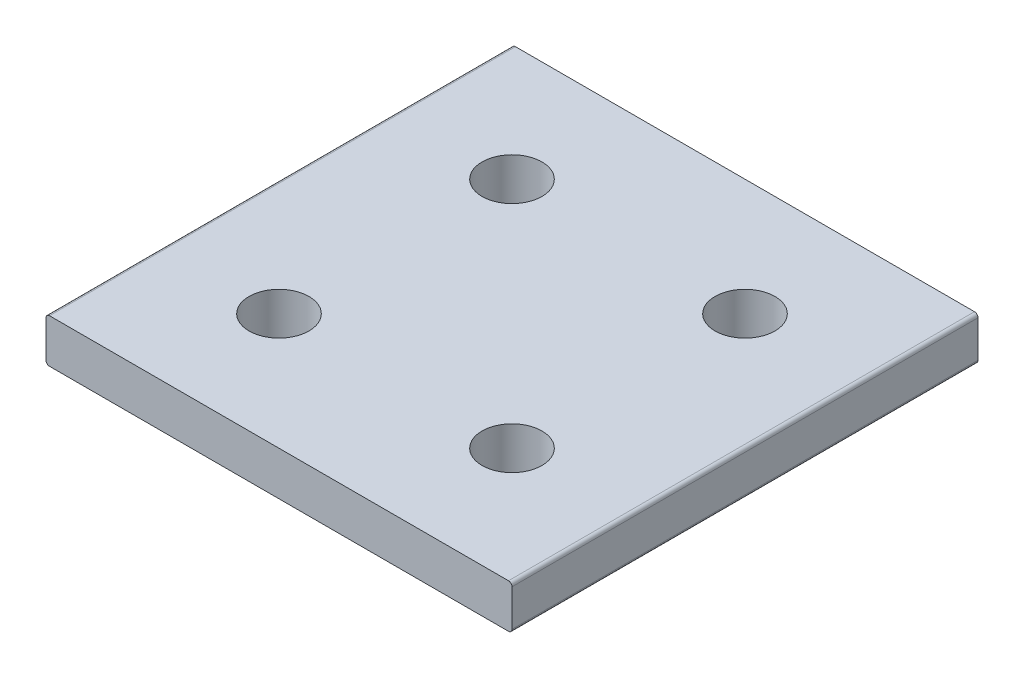
ISO-10303-21;
HEADER;
FILE_DESCRIPTION(('STEP AP214'),'2;1');
FILE_NAME('part.step','',(''),(''),'','','');
FILE_SCHEMA(('AUTOMOTIVE_DESIGN { 1 0 10303 214 1 1 1 1 }'));
ENDSEC;
DATA;
#1=APPLICATION_CONTEXT('core data for automotive mechanical design processes');
#2=APPLICATION_PROTOCOL_DEFINITION('international standard','automotive_design',2000,#1);
#3=PRODUCT_CONTEXT('',#1,'mechanical');
#4=PRODUCT('Part','Part','',(#3));
#5=PRODUCT_RELATED_PRODUCT_CATEGORY('part','',(#4));
#6=PRODUCT_DEFINITION_FORMATION('','',#4);
#7=PRODUCT_DEFINITION_CONTEXT('part definition',#1,'design');
#8=PRODUCT_DEFINITION('design','',#6,#7);
#9=PRODUCT_DEFINITION_SHAPE('','',#8);
#10=(LENGTH_UNIT() NAMED_UNIT(*) SI_UNIT(.MILLI.,.METRE.));
#11=(NAMED_UNIT(*) PLANE_ANGLE_UNIT() SI_UNIT($,.RADIAN.));
#12=(NAMED_UNIT(*) SI_UNIT($,.STERADIAN.) SOLID_ANGLE_UNIT());
#13=UNCERTAINTY_MEASURE_WITH_UNIT(LENGTH_MEASURE(1.E-05),#10,'distance_accuracy_value','');
#14=(GEOMETRIC_REPRESENTATION_CONTEXT(3) GLOBAL_UNCERTAINTY_ASSIGNED_CONTEXT((#13)) GLOBAL_UNIT_ASSIGNED_CONTEXT((#10,
#11,#12)) REPRESENTATION_CONTEXT('',''));
#15=CARTESIAN_POINT('',(0.,0.,0.));
#16=DIRECTION('',(0.,0.,1.));
#17=DIRECTION('',(1.,0.,0.));
#18=AXIS2_PLACEMENT_3D('',#15,#16,#17);
#19=CARTESIAN_POINT('',(0.,4.7752,50.8));
#20=DIRECTION('',(-1.,0.,0.));
#21=DIRECTION('',(0.,0.,1.));
#22=AXIS2_PLACEMENT_3D('',#19,#20,#21);
#23=PLANE('',#22);
#24=DIRECTION('',(0.,-1.,0.));
#25=VECTOR('',#24,1.);
#26=CARTESIAN_POINT('',(0.,4.7752,50.8));
#27=LINE('',#26,#25);
#28=CARTESIAN_POINT('',(0.,4.39420000000004,50.8));
#29=VERTEX_POINT('',#28);
#30=CARTESIAN_POINT('',(0.,0.380999999999964,50.8));
#31=VERTEX_POINT('',#30);
#32=EDGE_CURVE('E102',#29,#31,#27,.T.);
#33=ORIENTED_EDGE('',*,*,#32,.F.);
#34=DIRECTION('',(0.,0.,-1.));
#35=VECTOR('',#34,1.);
#36=CARTESIAN_POINT('',(0.,4.39420000000004,0.));
#37=LINE('',#36,#35);
#38=CARTESIAN_POINT('',(0.,4.39420000000004,0.));
#39=VERTEX_POINT('',#38);
#40=EDGE_CURVE('E114',#29,#39,#37,.T.);
#41=ORIENTED_EDGE('',*,*,#40,.T.);
#42=DIRECTION('',(0.,-1.,0.));
#43=VECTOR('',#42,1.);
#44=CARTESIAN_POINT('',(0.,4.7752,0.));
#45=LINE('',#44,#43);
#46=CARTESIAN_POINT('',(0.,0.380999999999964,0.));
#47=VERTEX_POINT('',#46);
#48=EDGE_CURVE('E245',#39,#47,#45,.T.);
#49=ORIENTED_EDGE('',*,*,#48,.T.);
#50=DIRECTION('',(0.,0.,-1.));
#51=VECTOR('',#50,1.);
#52=CARTESIAN_POINT('',(0.,0.380999999999964,50.8));
#53=LINE('',#52,#51);
#54=EDGE_CURVE('E117',#47,#31,#53,.F.);
#55=ORIENTED_EDGE('',*,*,#54,.T.);
#56=EDGE_LOOP('',(#33,#41,#49,#55));
#57=FACE_BOUND('',#56,.T.);
#58=ADVANCED_FACE('F32',(#57),#23,.T.);
#59=CARTESIAN_POINT('',(50.8,4.7752,50.8));
#60=DIRECTION('',(0.,0.,1.));
#61=DIRECTION('',(1.,0.,0.));
#62=AXIS2_PLACEMENT_3D('',#59,#60,#61);
#63=PLANE('',#62);
#64=DIRECTION('',(-1.,0.,0.));
#65=VECTOR('',#64,1.);
#66=CARTESIAN_POINT('',(50.8,4.7752,50.8));
#67=LINE('',#66,#65);
#68=CARTESIAN_POINT('',(50.419,4.7752,50.8));
#69=VERTEX_POINT('',#68);
#70=CARTESIAN_POINT('',(0.380999999999979,4.7752,50.8));
#71=VERTEX_POINT('',#70);
#72=EDGE_CURVE('E105',#69,#71,#67,.T.);
#73=ORIENTED_EDGE('',*,*,#72,.T.);
#74=CARTESIAN_POINT('',(0.380999999999964,4.39420000000004,50.8));
#75=DIRECTION('',(0.,0.,1.));
#76=DIRECTION('',(1.,0.,0.));
#77=AXIS2_PLACEMENT_3D('',#74,#75,#76);
#78=CIRCLE('',#77,0.380999999999964);
#79=EDGE_CURVE('E99',#71,#29,#78,.T.);
#80=ORIENTED_EDGE('',*,*,#79,.T.);
#81=ORIENTED_EDGE('',*,*,#32,.T.);
#82=CARTESIAN_POINT('',(0.380999999999964,0.380999999999964,50.8));
#83=DIRECTION('',(0.,0.,1.));
#84=DIRECTION('',(1.,0.,0.));
#85=AXIS2_PLACEMENT_3D('',#82,#83,#84);
#86=CIRCLE('',#85,0.380999999999964);
#87=CARTESIAN_POINT('',(0.380999999999979,0.,50.8));
#88=VERTEX_POINT('',#87);
#89=EDGE_CURVE('E138',#31,#88,#86,.T.);
#90=ORIENTED_EDGE('',*,*,#89,.T.);
#91=DIRECTION('',(-1.,0.,0.));
#92=VECTOR('',#91,1.);
#93=CARTESIAN_POINT('',(50.8,0.,50.8));
#94=LINE('',#93,#92);
#95=CARTESIAN_POINT('',(50.419,0.,50.8));
#96=VERTEX_POINT('',#95);
#97=EDGE_CURVE('E243',#96,#88,#94,.T.);
#98=ORIENTED_EDGE('',*,*,#97,.F.);
#99=CARTESIAN_POINT('',(50.419,0.380999999999964,50.8));
#100=DIRECTION('',(0.,0.,1.));
#101=DIRECTION('',(1.,0.,0.));
#102=AXIS2_PLACEMENT_3D('',#99,#100,#101);
#103=CIRCLE('',#102,0.380999999999964);
#104=CARTESIAN_POINT('',(50.8,0.380999999999964,50.8));
#105=VERTEX_POINT('',#104);
#106=EDGE_CURVE('E47',#96,#105,#103,.T.);
#107=ORIENTED_EDGE('',*,*,#106,.T.);
#108=DIRECTION('',(0.,-1.,0.));
#109=VECTOR('',#108,1.);
#110=CARTESIAN_POINT('',(50.8,4.7752,50.8));
#111=LINE('',#110,#109);
#112=CARTESIAN_POINT('',(50.8,4.39420000000004,50.8));
#113=VERTEX_POINT('',#112);
#114=EDGE_CURVE('E118',#113,#105,#111,.T.);
#115=ORIENTED_EDGE('',*,*,#114,.F.);
#116=CARTESIAN_POINT('',(50.419,4.39420000000004,50.8));
#117=DIRECTION('',(0.,0.,1.));
#118=DIRECTION('',(1.,0.,0.));
#119=AXIS2_PLACEMENT_3D('',#116,#117,#118);
#120=CIRCLE('',#119,0.380999999999964);
#121=EDGE_CURVE('E55',#113,#69,#120,.T.);
#122=ORIENTED_EDGE('',*,*,#121,.T.);
#123=EDGE_LOOP('',(#73,#80,#81,#90,#98,#107,#115,#122));
#124=FACE_BOUND('',#123,.T.);
#125=ADVANCED_FACE('F101',(#124),#63,.T.);
#126=CARTESIAN_POINT('',(50.8,4.7752,0.));
#127=DIRECTION('',(1.,0.,0.));
#128=DIRECTION('',(0.,0.,-1.));
#129=AXIS2_PLACEMENT_3D('',#126,#127,#128);
#130=PLANE('',#129);
#131=DIRECTION('',(0.,-1.,0.));
#132=VECTOR('',#131,1.);
#133=CARTESIAN_POINT('',(50.8,4.7752,0.));
#134=LINE('',#133,#132);
#135=CARTESIAN_POINT('',(50.8,4.39420000000004,0.));
#136=VERTEX_POINT('',#135);
#137=CARTESIAN_POINT('',(50.8,0.380999999999964,0.));
#138=VERTEX_POINT('',#137);
#139=EDGE_CURVE('E251',#136,#138,#134,.T.);
#140=ORIENTED_EDGE('',*,*,#139,.F.);
#141=DIRECTION('',(0.,0.,1.));
#142=VECTOR('',#141,1.);
#143=CARTESIAN_POINT('',(50.8,4.39420000000004,50.8));
#144=LINE('',#143,#142);
#145=EDGE_CURVE('E142',#136,#113,#144,.T.);
#146=ORIENTED_EDGE('',*,*,#145,.T.);
#147=ORIENTED_EDGE('',*,*,#114,.T.);
#148=DIRECTION('',(0.,0.,1.));
#149=VECTOR('',#148,1.);
#150=CARTESIAN_POINT('',(50.8,0.380999999999964,0.));
#151=LINE('',#150,#149);
#152=EDGE_CURVE('E109',#105,#138,#151,.F.);
#153=ORIENTED_EDGE('',*,*,#152,.T.);
#154=EDGE_LOOP('',(#140,#146,#147,#153));
#155=FACE_BOUND('',#154,.T.);
#156=ADVANCED_FACE('F177',(#155),#130,.T.);
#157=CARTESIAN_POINT('',(0.,4.7752,0.));
#158=DIRECTION('',(0.,0.,-1.));
#159=DIRECTION('',(-1.,0.,0.));
#160=AXIS2_PLACEMENT_3D('',#157,#158,#159);
#161=PLANE('',#160);
#162=ORIENTED_EDGE('',*,*,#48,.F.);
#163=CARTESIAN_POINT('',(0.380999999999964,4.39420000000004,0.));
#164=DIRECTION('',(0.,0.,-1.));
#165=DIRECTION('',(-1.,0.,0.));
#166=AXIS2_PLACEMENT_3D('',#163,#164,#165);
#167=CIRCLE('',#166,0.380999999999964);
#168=CARTESIAN_POINT('',(0.380999999999964,4.7752,0.));
#169=VERTEX_POINT('',#168);
#170=EDGE_CURVE('E121',#39,#169,#167,.T.);
#171=ORIENTED_EDGE('',*,*,#170,.T.);
#172=DIRECTION('',(1.,0.,0.));
#173=VECTOR('',#172,1.);
#174=CARTESIAN_POINT('',(0.,4.7752,0.));
#175=LINE('',#174,#173);
#176=CARTESIAN_POINT('',(50.419,4.7752,0.));
#177=VERTEX_POINT('',#176);
#178=EDGE_CURVE('E240',#169,#177,#175,.T.);
#179=ORIENTED_EDGE('',*,*,#178,.T.);
#180=CARTESIAN_POINT('',(50.419,4.39420000000004,0.));
#181=DIRECTION('',(0.,0.,-1.));
#182=DIRECTION('',(-1.,0.,0.));
#183=AXIS2_PLACEMENT_3D('',#180,#181,#182);
#184=CIRCLE('',#183,0.380999999999964);
#185=EDGE_CURVE('E130',#177,#136,#184,.T.);
#186=ORIENTED_EDGE('',*,*,#185,.T.);
#187=ORIENTED_EDGE('',*,*,#139,.T.);
#188=CARTESIAN_POINT('',(50.419,0.380999999999964,0.));
#189=DIRECTION('',(0.,0.,-1.));
#190=DIRECTION('',(-1.,0.,0.));
#191=AXIS2_PLACEMENT_3D('',#188,#189,#190);
#192=CIRCLE('',#191,0.380999999999964);
#193=CARTESIAN_POINT('',(50.419,0.,0.));
#194=VERTEX_POINT('',#193);
#195=EDGE_CURVE('E122',#138,#194,#192,.T.);
#196=ORIENTED_EDGE('',*,*,#195,.T.);
#197=DIRECTION('',(1.,0.,0.));
#198=VECTOR('',#197,1.);
#199=CARTESIAN_POINT('',(0.,0.,0.));
#200=LINE('',#199,#198);
#201=CARTESIAN_POINT('',(0.380999999999964,0.,0.));
#202=VERTEX_POINT('',#201);
#203=EDGE_CURVE('E233',#202,#194,#200,.T.);
#204=ORIENTED_EDGE('',*,*,#203,.F.);
#205=CARTESIAN_POINT('',(0.380999999999964,0.380999999999964,0.));
#206=DIRECTION('',(0.,0.,-1.));
#207=DIRECTION('',(-1.,0.,0.));
#208=AXIS2_PLACEMENT_3D('',#205,#206,#207);
#209=CIRCLE('',#208,0.380999999999964);
#210=EDGE_CURVE('E124',#202,#47,#209,.T.);
#211=ORIENTED_EDGE('',*,*,#210,.T.);
#212=EDGE_LOOP('',(#162,#171,#179,#186,#187,#196,#204,#211));
#213=FACE_BOUND('',#212,.T.);
#214=ADVANCED_FACE('F167',(#213),#161,.T.);
#215=CARTESIAN_POINT('',(0.,4.7752,0.));
#216=DIRECTION('',(0.,-1.,0.));
#217=DIRECTION('',(0.,0.,-1.));
#218=AXIS2_PLACEMENT_3D('',#215,#216,#217);
#219=PLANE('',#218);
#220=CARTESIAN_POINT('',(12.7,4.7752,38.1));
#221=DIRECTION('',(0.,1.,0.));
#222=DIRECTION('',(0.,0.,1.));
#223=AXIS2_PLACEMENT_3D('',#220,#221,#222);
#224=CIRCLE('',#223,3.2639);
#225=CARTESIAN_POINT('',(12.7,4.7752,41.3639));
#226=VERTEX_POINT('',#225);
#227=EDGE_CURVE('E231',#226,#226,#224,.T.);
#228=ORIENTED_EDGE('',*,*,#227,.F.);
#229=EDGE_LOOP('',(#228));
#230=FACE_BOUND('',#229,.T.);
#231=CARTESIAN_POINT('',(38.1,4.7752,38.1));
#232=DIRECTION('',(0.,1.,0.));
#233=DIRECTION('',(0.,0.,1.));
#234=AXIS2_PLACEMENT_3D('',#231,#232,#233);
#235=CIRCLE('',#234,3.2639);
#236=CARTESIAN_POINT('',(38.1,4.7752,41.3639));
#237=VERTEX_POINT('',#236);
#238=EDGE_CURVE('E230',#237,#237,#235,.T.);
#239=ORIENTED_EDGE('',*,*,#238,.F.);
#240=EDGE_LOOP('',(#239));
#241=FACE_BOUND('',#240,.T.);
#242=ORIENTED_EDGE('',*,*,#178,.F.);
#243=DIRECTION('',(0.,0.,-1.));
#244=VECTOR('',#243,1.);
#245=CARTESIAN_POINT('',(0.380999999999964,4.7752,50.8));
#246=LINE('',#245,#244);
#247=EDGE_CURVE('E135',#169,#71,#246,.F.);
#248=ORIENTED_EDGE('',*,*,#247,.T.);
#249=ORIENTED_EDGE('',*,*,#72,.F.);
#250=DIRECTION('',(0.,0.,1.));
#251=VECTOR('',#250,1.);
#252=CARTESIAN_POINT('',(50.419,4.7752,0.));
#253=LINE('',#252,#251);
#254=EDGE_CURVE('E133',#69,#177,#253,.F.);
#255=ORIENTED_EDGE('',*,*,#254,.T.);
#256=EDGE_LOOP('',(#242,#248,#249,#255));
#257=FACE_BOUND('',#256,.T.);
#258=CARTESIAN_POINT('',(38.1,4.7752,12.7));
#259=DIRECTION('',(0.,1.,0.));
#260=DIRECTION('',(0.,0.,1.));
#261=AXIS2_PLACEMENT_3D('',#258,#259,#260);
#262=CIRCLE('',#261,3.2639);
#263=CARTESIAN_POINT('',(38.1,4.7752,15.9639));
#264=VERTEX_POINT('',#263);
#265=EDGE_CURVE('E153',#264,#264,#262,.T.);
#266=ORIENTED_EDGE('',*,*,#265,.F.);
#267=EDGE_LOOP('',(#266));
#268=FACE_BOUND('',#267,.T.);
#269=CARTESIAN_POINT('',(12.7,4.7752,12.7));
#270=DIRECTION('',(0.,1.,0.));
#271=DIRECTION('',(0.,0.,1.));
#272=AXIS2_PLACEMENT_3D('',#269,#270,#271);
#273=CIRCLE('',#272,3.2639);
#274=CARTESIAN_POINT('',(12.7,4.7752,15.9639));
#275=VERTEX_POINT('',#274);
#276=EDGE_CURVE('E11',#275,#275,#273,.T.);
#277=ORIENTED_EDGE('',*,*,#276,.F.);
#278=EDGE_LOOP('',(#277));
#279=FACE_BOUND('',#278,.T.);
#280=ADVANCED_FACE('F165',(#230,#241,#257,#268,#279),#219,.F.);
#281=CARTESIAN_POINT('',(0.,0.,0.));
#282=DIRECTION('',(0.,-1.,0.));
#283=DIRECTION('',(0.,0.,-1.));
#284=AXIS2_PLACEMENT_3D('',#281,#282,#283);
#285=PLANE('',#284);
#286=CARTESIAN_POINT('',(12.7,0.,38.1));
#287=DIRECTION('',(0.,1.,0.));
#288=DIRECTION('',(0.,0.,1.));
#289=AXIS2_PLACEMENT_3D('',#286,#287,#288);
#290=CIRCLE('',#289,3.2639);
#291=CARTESIAN_POINT('',(12.7,0.,41.3639));
#292=VERTEX_POINT('',#291);
#293=EDGE_CURVE('E236',#292,#292,#290,.T.);
#294=ORIENTED_EDGE('',*,*,#293,.T.);
#295=EDGE_LOOP('',(#294));
#296=FACE_BOUND('',#295,.T.);
#297=CARTESIAN_POINT('',(38.1,0.,38.1));
#298=DIRECTION('',(0.,1.,0.));
#299=DIRECTION('',(0.,0.,1.));
#300=AXIS2_PLACEMENT_3D('',#297,#298,#299);
#301=CIRCLE('',#300,3.2639);
#302=CARTESIAN_POINT('',(38.1,0.,41.3639));
#303=VERTEX_POINT('',#302);
#304=EDGE_CURVE('E227',#303,#303,#301,.T.);
#305=ORIENTED_EDGE('',*,*,#304,.T.);
#306=EDGE_LOOP('',(#305));
#307=FACE_BOUND('',#306,.T.);
#308=ORIENTED_EDGE('',*,*,#97,.T.);
#309=DIRECTION('',(0.,0.,-1.));
#310=VECTOR('',#309,1.);
#311=CARTESIAN_POINT('',(0.380999999999964,0.,0.));
#312=LINE('',#311,#310);
#313=EDGE_CURVE('E147',#88,#202,#312,.T.);
#314=ORIENTED_EDGE('',*,*,#313,.T.);
#315=ORIENTED_EDGE('',*,*,#203,.T.);
#316=DIRECTION('',(0.,0.,1.));
#317=VECTOR('',#316,1.);
#318=CARTESIAN_POINT('',(50.419,0.,0.));
#319=LINE('',#318,#317);
#320=EDGE_CURVE('E144',#194,#96,#319,.T.);
#321=ORIENTED_EDGE('',*,*,#320,.T.);
#322=EDGE_LOOP('',(#308,#314,#315,#321));
#323=FACE_BOUND('',#322,.T.);
#324=CARTESIAN_POINT('',(38.1,0.,12.7));
#325=DIRECTION('',(0.,1.,0.));
#326=DIRECTION('',(0.,0.,1.));
#327=AXIS2_PLACEMENT_3D('',#324,#325,#326);
#328=CIRCLE('',#327,3.2639);
#329=CARTESIAN_POINT('',(38.1,0.,15.9639));
#330=VERTEX_POINT('',#329);
#331=EDGE_CURVE('E150',#330,#330,#328,.T.);
#332=ORIENTED_EDGE('',*,*,#331,.T.);
#333=EDGE_LOOP('',(#332));
#334=FACE_BOUND('',#333,.T.);
#335=CARTESIAN_POINT('',(12.7,0.,12.7));
#336=DIRECTION('',(0.,1.,0.));
#337=DIRECTION('',(0.,0.,1.));
#338=AXIS2_PLACEMENT_3D('',#335,#336,#337);
#339=CIRCLE('',#338,3.2639);
#340=CARTESIAN_POINT('',(12.7,0.,15.9639));
#341=VERTEX_POINT('',#340);
#342=EDGE_CURVE('E40',#341,#341,#339,.T.);
#343=ORIENTED_EDGE('',*,*,#342,.T.);
#344=EDGE_LOOP('',(#343));
#345=FACE_BOUND('',#344,.T.);
#346=ADVANCED_FACE('F158',(#296,#307,#323,#334,#345),#285,.T.);
#347=CARTESIAN_POINT('',(38.1,4.7752,38.1));
#348=DIRECTION('',(0.,1.,0.));
#349=DIRECTION('',(0.,0.,1.));
#350=AXIS2_PLACEMENT_3D('',#347,#348,#349);
#351=CYLINDRICAL_SURFACE('',#350,3.2639);
#352=ORIENTED_EDGE('',*,*,#304,.F.);
#353=EDGE_LOOP('',(#352));
#354=FACE_BOUND('',#353,.T.);
#355=ORIENTED_EDGE('',*,*,#238,.T.);
#356=EDGE_LOOP('',(#355));
#357=FACE_BOUND('',#356,.T.);
#358=ADVANCED_FACE('F174',(#354,#357),#351,.F.);
#359=CARTESIAN_POINT('',(0.380999999999964,4.39420000000004,50.8));
#360=DIRECTION('',(0.,0.,1.));
#361=DIRECTION('',(1.,0.,0.));
#362=AXIS2_PLACEMENT_3D('',#359,#360,#361);
#363=CYLINDRICAL_SURFACE('',#362,0.380999999999964);
#364=ORIENTED_EDGE('',*,*,#79,.F.);
#365=ORIENTED_EDGE('',*,*,#247,.F.);
#366=ORIENTED_EDGE('',*,*,#170,.F.);
#367=ORIENTED_EDGE('',*,*,#40,.F.);
#368=EDGE_LOOP('',(#364,#365,#366,#367));
#369=FACE_BOUND('',#368,.T.);
#370=ADVANCED_FACE('F120',(#369),#363,.T.);
#371=CARTESIAN_POINT('',(50.419,4.39420000000004,0.));
#372=DIRECTION('',(0.,0.,-1.));
#373=DIRECTION('',(-1.,0.,0.));
#374=AXIS2_PLACEMENT_3D('',#371,#372,#373);
#375=CYLINDRICAL_SURFACE('',#374,0.380999999999964);
#376=ORIENTED_EDGE('',*,*,#185,.F.);
#377=ORIENTED_EDGE('',*,*,#254,.F.);
#378=ORIENTED_EDGE('',*,*,#121,.F.);
#379=ORIENTED_EDGE('',*,*,#145,.F.);
#380=EDGE_LOOP('',(#376,#377,#378,#379));
#381=FACE_BOUND('',#380,.T.);
#382=ADVANCED_FACE('F193',(#381),#375,.T.);
#383=CARTESIAN_POINT('',(0.380999999999964,0.380999999999964,0.));
#384=DIRECTION('',(0.,0.,-1.));
#385=DIRECTION('',(-1.,0.,0.));
#386=AXIS2_PLACEMENT_3D('',#383,#384,#385);
#387=CYLINDRICAL_SURFACE('',#386,0.380999999999964);
#388=ORIENTED_EDGE('',*,*,#89,.F.);
#389=ORIENTED_EDGE('',*,*,#54,.F.);
#390=ORIENTED_EDGE('',*,*,#210,.F.);
#391=ORIENTED_EDGE('',*,*,#313,.F.);
#392=EDGE_LOOP('',(#388,#389,#390,#391));
#393=FACE_BOUND('',#392,.T.);
#394=ADVANCED_FACE('F196',(#393),#387,.T.);
#395=CARTESIAN_POINT('',(50.419,0.380999999999964,0.));
#396=DIRECTION('',(0.,0.,1.));
#397=DIRECTION('',(1.,0.,0.));
#398=AXIS2_PLACEMENT_3D('',#395,#396,#397);
#399=CYLINDRICAL_SURFACE('',#398,0.380999999999964);
#400=ORIENTED_EDGE('',*,*,#195,.F.);
#401=ORIENTED_EDGE('',*,*,#152,.F.);
#402=ORIENTED_EDGE('',*,*,#106,.F.);
#403=ORIENTED_EDGE('',*,*,#320,.F.);
#404=EDGE_LOOP('',(#400,#401,#402,#403));
#405=FACE_BOUND('',#404,.T.);
#406=ADVANCED_FACE('F199',(#405),#399,.T.);
#407=CARTESIAN_POINT('',(12.7,4.7752,38.1));
#408=DIRECTION('',(0.,1.,0.));
#409=DIRECTION('',(0.,0.,1.));
#410=AXIS2_PLACEMENT_3D('',#407,#408,#409);
#411=CYLINDRICAL_SURFACE('',#410,3.2639);
#412=ORIENTED_EDGE('',*,*,#293,.F.);
#413=EDGE_LOOP('',(#412));
#414=FACE_BOUND('',#413,.T.);
#415=ORIENTED_EDGE('',*,*,#227,.T.);
#416=EDGE_LOOP('',(#415));
#417=FACE_BOUND('',#416,.T.);
#418=ADVANCED_FACE('F202',(#414,#417),#411,.F.);
#419=CARTESIAN_POINT('',(38.1,4.7752,12.7));
#420=DIRECTION('',(0.,1.,0.));
#421=DIRECTION('',(0.,0.,1.));
#422=AXIS2_PLACEMENT_3D('',#419,#420,#421);
#423=CYLINDRICAL_SURFACE('',#422,3.2639);
#424=ORIENTED_EDGE('',*,*,#331,.F.);
#425=EDGE_LOOP('',(#424));
#426=FACE_BOUND('',#425,.T.);
#427=ORIENTED_EDGE('',*,*,#265,.T.);
#428=EDGE_LOOP('',(#427));
#429=FACE_BOUND('',#428,.T.);
#430=ADVANCED_FACE('F162',(#426,#429),#423,.F.);
#431=CARTESIAN_POINT('',(12.7,4.7752,12.7));
#432=DIRECTION('',(0.,1.,0.));
#433=DIRECTION('',(0.,0.,1.));
#434=AXIS2_PLACEMENT_3D('',#431,#432,#433);
#435=CYLINDRICAL_SURFACE('',#434,3.2639);
#436=ORIENTED_EDGE('',*,*,#342,.F.);
#437=EDGE_LOOP('',(#436));
#438=FACE_BOUND('',#437,.T.);
#439=ORIENTED_EDGE('',*,*,#276,.T.);
#440=EDGE_LOOP('',(#439));
#441=FACE_BOUND('',#440,.T.);
#442=ADVANCED_FACE('F34',(#438,#441),#435,.F.);
#443=CLOSED_SHELL('',(#58,#125,#156,#214,#280,#346,#358,#370,#382,#394,#406,#418,#430,#442));
#444=MANIFOLD_SOLID_BREP('B2',#443);
#445=ADVANCED_BREP_SHAPE_REPRESENTATION('',(#18,#444),#14);
#446=SHAPE_DEFINITION_REPRESENTATION(#9,#445);
ENDSEC;
END-ISO-10303-21;
